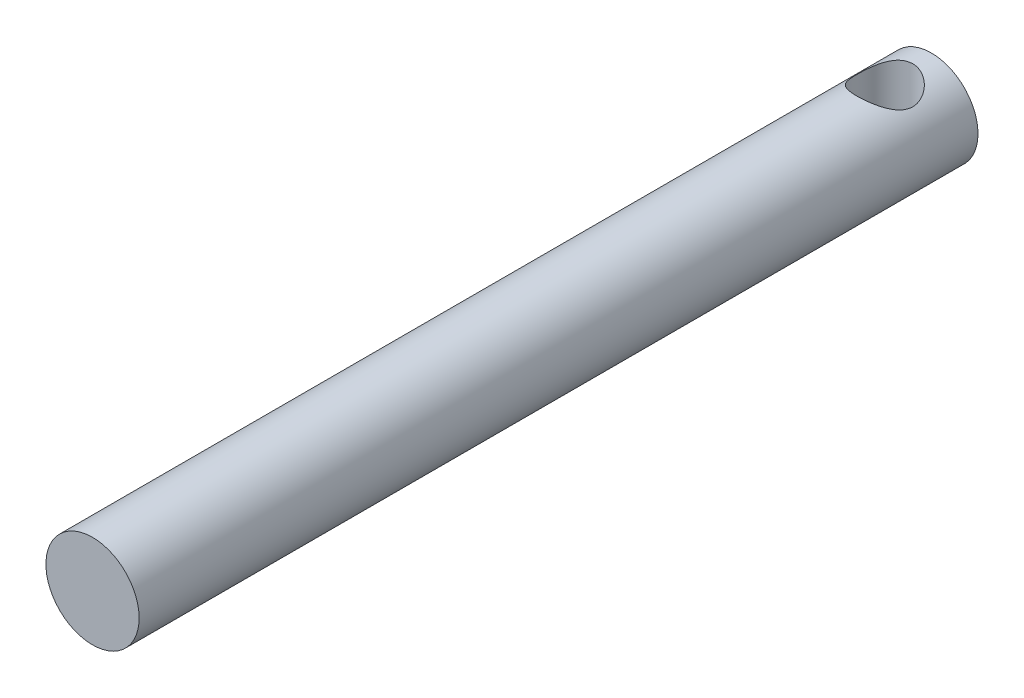
ISO-10303-21;
HEADER;
FILE_DESCRIPTION(('STEP AP214'),'2;1');
FILE_NAME('part.step','',(''),(''),'','','');
FILE_SCHEMA(('AUTOMOTIVE_DESIGN { 1 0 10303 214 1 1 1 1 }'));
ENDSEC;
DATA;
#1=APPLICATION_CONTEXT('core data for automotive mechanical design processes');
#2=APPLICATION_PROTOCOL_DEFINITION('international standard','automotive_design',2000,#1);
#3=PRODUCT_CONTEXT('',#1,'mechanical');
#4=PRODUCT('Part','Part','',(#3));
#5=PRODUCT_RELATED_PRODUCT_CATEGORY('part','',(#4));
#6=PRODUCT_DEFINITION_FORMATION('','',#4);
#7=PRODUCT_DEFINITION_CONTEXT('part definition',#1,'design');
#8=PRODUCT_DEFINITION('design','',#6,#7);
#9=PRODUCT_DEFINITION_SHAPE('','',#8);
#10=(LENGTH_UNIT() NAMED_UNIT(*) SI_UNIT(.MILLI.,.METRE.));
#11=(NAMED_UNIT(*) PLANE_ANGLE_UNIT() SI_UNIT($,.RADIAN.));
#12=(NAMED_UNIT(*) SI_UNIT($,.STERADIAN.) SOLID_ANGLE_UNIT());
#13=UNCERTAINTY_MEASURE_WITH_UNIT(LENGTH_MEASURE(1.E-05),#10,'distance_accuracy_value','');
#14=(GEOMETRIC_REPRESENTATION_CONTEXT(3) GLOBAL_UNCERTAINTY_ASSIGNED_CONTEXT((#13)) GLOBAL_UNIT_ASSIGNED_CONTEXT((#10,
#11,#12)) REPRESENTATION_CONTEXT('',''));
#15=CARTESIAN_POINT('',(0.,0.,0.));
#16=DIRECTION('',(0.,0.,1.));
#17=DIRECTION('',(1.,0.,0.));
#18=AXIS2_PLACEMENT_3D('',#15,#16,#17);
#19=CARTESIAN_POINT('',(-13.5091901350102,11.4106751625815,180.));
#20=DIRECTION('',(0.,0.,-1.));
#21=DIRECTION('',(-1.,0.,0.));
#22=AXIS2_PLACEMENT_3D('',#19,#20,#21);
#23=CYLINDRICAL_SURFACE('',#22,10.);
#24=CARTESIAN_POINT('',(-13.5091901350102,11.4106751625815,180.));
#25=DIRECTION('',(0.,0.,1.));
#26=DIRECTION('',(1.,0.,0.));
#27=AXIS2_PLACEMENT_3D('',#24,#25,#26);
#28=CIRCLE('',#27,10.);
#29=CARTESIAN_POINT('',(-3.50919013501023,11.4106751625815,180.));
#30=VERTEX_POINT('',#29);
#31=EDGE_CURVE('E10',#30,#30,#28,.T.);
#32=ORIENTED_EDGE('',*,*,#31,.F.);
#33=EDGE_LOOP('',(#32));
#34=FACE_BOUND('',#33,.T.);
#35=CARTESIAN_POINT('',(-13.5091901350102,11.4106751625815,0.));
#36=DIRECTION('',(0.,0.,1.));
#37=DIRECTION('',(1.,0.,0.));
#38=AXIS2_PLACEMENT_3D('',#35,#36,#37);
#39=CIRCLE('',#38,10.);
#40=CARTESIAN_POINT('',(-3.50919013501023,11.4106751625815,0.));
#41=VERTEX_POINT('',#40);
#42=EDGE_CURVE('E44',#41,#41,#39,.T.);
#43=ORIENTED_EDGE('',*,*,#42,.T.);
#44=EDGE_LOOP('',(#43));
#45=FACE_BOUND('',#44,.T.);
#46=CARTESIAN_POINT('',(-13.5091901350102,1.41067516258146,4.00000000000001));
#47=CARTESIAN_POINT('',(-13.3556526904588,1.41067633089501,4.00000125480863));
#48=CARTESIAN_POINT('',(-13.2020764056153,1.41422020166984,4.00590264260054));
#49=CARTESIAN_POINT('',(-12.8960826136834,1.42831151794474,4.02943301315885));
#50=CARTESIAN_POINT('',(-12.7436658374102,1.43886306127211,4.04706885781215));
#51=CARTESIAN_POINT('',(-12.4409426835004,1.46673266339194,4.09387210434918));
#52=CARTESIAN_POINT('',(-12.290640862491,1.48406353208247,4.1230613382259));
#53=CARTESIAN_POINT('',(-11.9934701077363,1.52507410980967,4.19259993825845));
#54=CARTESIAN_POINT('',(-11.8466026689503,1.54875652968652,4.23295406982232));
#55=CARTESIAN_POINT('',(-11.5580945197007,1.60177034291241,4.32408760089697));
#56=CARTESIAN_POINT('',(-11.416429738108,1.631070330933,4.37480914043));
#57=CARTESIAN_POINT('',(-11.1382592970138,1.69475587741807,4.48627436911144));
#58=CARTESIAN_POINT('',(-11.0017556559548,1.72914340023012,4.5470219304578));
#59=CARTESIAN_POINT('',(-10.601227218424,1.8388335395481,4.74338407851943));
#60=CARTESIAN_POINT('',(-10.3458203590017,1.92073348435578,4.89323485933393));
#61=CARTESIAN_POINT('',(-9.84395243429926,2.10246446164923,5.23910814308137));
#62=CARTESIAN_POINT('',(-9.59966901020869,2.20318776396261,5.43778513248692));
#63=CARTESIAN_POINT('',(-9.14564434458899,2.40947332513383,5.86989850217798));
#64=CARTESIAN_POINT('',(-8.93594811126803,2.51504166413627,6.10337943262662));
#65=CARTESIAN_POINT('',(-8.63836434718179,2.67626349301655,6.49199899782079));
#66=CARTESIAN_POINT('',(-8.53736682658386,2.73351791785553,6.63663261824515));
#67=CARTESIAN_POINT('',(-8.34796890769963,2.84482198475617,6.93519435737639));
#68=CARTESIAN_POINT('',(-8.25957058995719,2.89887109665648,7.08912400520267));
#69=CARTESIAN_POINT('',(-8.09628238263426,3.00176672522986,7.40537768241328));
#70=CARTESIAN_POINT('',(-8.02137485315563,3.05062000097349,7.56769038766835));
#71=CARTESIAN_POINT('',(-7.88580850147011,3.14119926934413,7.90005817081948));
#72=CARTESIAN_POINT('',(-7.82514436188687,3.18292792016087,8.07011033100857));
#73=CARTESIAN_POINT('',(-7.73181791608264,3.24829904703414,8.37492007913803));
#74=CARTESIAN_POINT('',(-7.69593123990293,3.27387561962415,8.5082833488659));
#75=CARTESIAN_POINT('',(-7.63328974150352,3.31899495134789,8.7781295178189));
#76=CARTESIAN_POINT('',(-7.60653289619657,3.33853904713176,8.91461171875597));
#77=CARTESIAN_POINT('',(-7.56252042961355,3.37090726380086,9.18974828597867));
#78=CARTESIAN_POINT('',(-7.54525504469453,3.38373828960505,9.32840026864179));
#79=CARTESIAN_POINT('',(-7.52043747120673,3.4022369086812,9.60705501530098));
#80=CARTESIAN_POINT('',(-7.51288544983306,3.4079043786476,9.74705780250652));
#81=CARTESIAN_POINT('',(-7.50761022729805,3.41185960957051,10.027630485736));
#82=CARTESIAN_POINT('',(-7.50990640534626,3.41013282017214,10.1682009556071));
#83=CARTESIAN_POINT('',(-7.52433344890707,3.39933508904413,10.448547368446));
#84=CARTESIAN_POINT('',(-7.53646436220422,3.39026411163088,10.5883233075501));
#85=CARTESIAN_POINT('',(-7.5703842946277,3.36511551060935,10.8661231944088));
#86=CARTESIAN_POINT('',(-7.59217766853591,3.34903472780143,11.0041463233038));
#87=CARTESIAN_POINT('',(-7.64511119353327,3.31045044389858,11.277494591076));
#88=CARTESIAN_POINT('',(-7.6762551644796,3.28794431814091,11.4128186031844));
#89=CARTESIAN_POINT('',(-7.78220949699514,3.21255389168456,11.8099607815556));
#90=CARTESIAN_POINT('',(-7.8700381936975,3.15140628119719,12.0668706370872));
#91=CARTESIAN_POINT('',(-8.07738966007996,3.01359352679295,12.5628175566807));
#92=CARTESIAN_POINT('',(-8.19692404850848,2.93692269673821,12.8018480274799));
#93=CARTESIAN_POINT('',(-8.48848936537285,2.76045281522607,13.2999480266043));
#94=CARTESIAN_POINT('',(-8.66604463379952,2.65895374187928,13.5552148804663));
#95=CARTESIAN_POINT('',(-8.95961889220411,2.50485105529802,13.9147691760174));
#96=CARTESIAN_POINT('',(-9.06210694926763,2.45313380210121,14.0308102231317));
#97=CARTESIAN_POINT('',(-9.27589575699475,2.35014100583064,14.2547824138109));
#98=CARTESIAN_POINT('',(-9.38719807317838,2.29886554302554,14.3627121100362));
#99=CARTESIAN_POINT('',(-9.63437156022612,2.19078189687765,14.5844378033889));
#100=CARTESIAN_POINT('',(-9.77150218235584,2.13420233892975,14.6969446098408));
#101=CARTESIAN_POINT('',(-10.0560489055857,2.02456575116488,14.9099266645909));
#102=CARTESIAN_POINT('',(-10.2034609792843,1.97150735777188,15.0104065825761));
#103=CARTESIAN_POINT('',(-10.5078895353287,1.87034414124565,15.1984805100332));
#104=CARTESIAN_POINT('',(-10.6649048767325,1.82223873147523,15.2860760460744));
#105=CARTESIAN_POINT('',(-10.9876322992274,1.7323597166042,15.447410241838));
#106=CARTESIAN_POINT('',(-11.1533432976371,1.6905853257456,15.5211506214301));
#107=CARTESIAN_POINT('',(-11.4816173528806,1.61703260991048,15.649604220474));
#108=CARTESIAN_POINT('',(-11.6437216198297,1.58479049470757,15.705223147606));
#109=CARTESIAN_POINT('',(-11.9733429143315,1.52790560786429,15.8026459542524));
#110=CARTESIAN_POINT('',(-12.1408597863822,1.50326261811808,15.8444502302696));
#111=CARTESIAN_POINT('',(-12.4796964443595,1.46234697777783,15.9135444927888));
#112=CARTESIAN_POINT('',(-12.651012261636,1.44606598506837,15.9408489455662));
#113=CARTESIAN_POINT('',(-12.995963828978,1.42235847492357,15.9805289353702));
#114=CARTESIAN_POINT('',(-13.169599249275,1.41493071212589,15.9929065721187));
#115=CARTESIAN_POINT('',(-13.4937615407638,1.40955699642827,16.0018638200681));
#116=CARTESIAN_POINT('',(-13.6442204517033,1.41045916052588,16.0003625940574));
#117=CARTESIAN_POINT('',(-13.9444083961809,1.41902240356606,15.9860804379589));
#118=CARTESIAN_POINT('',(-14.0941374535988,1.42668325985994,15.9732998794413));
#119=CARTESIAN_POINT('',(-14.3917261916016,1.44857740972355,15.9366326369676));
#120=CARTESIAN_POINT('',(-14.5395859991371,1.46281025446386,15.9127467114441));
#121=CARTESIAN_POINT('',(-14.8324026071875,1.49750968958448,15.8541784518886));
#122=CARTESIAN_POINT('',(-14.9773593355284,1.51797643474231,15.8194958497924));
#123=CARTESIAN_POINT('',(-15.2599092213005,1.5641041180475,15.740727839033));
#124=CARTESIAN_POINT('',(-15.397595803268,1.58962482043852,15.6968948586283));
#125=CARTESIAN_POINT('',(-15.6685804277553,1.6456246196643,15.599801467025));
#126=CARTESIAN_POINT('',(-15.8018770397861,1.67610531388146,15.5465380182235));
#127=CARTESIAN_POINT('',(-16.1941154951224,1.77409806055428,15.3733367560108));
#128=CARTESIAN_POINT('',(-16.4456129988504,1.84819591132159,15.2399295203489));
#129=CARTESIAN_POINT('',(-16.9492514293292,2.01685816939208,14.9257648803305));
#130=CARTESIAN_POINT('',(-17.1987515501651,2.11274843013203,14.7415307371737));
#131=CARTESIAN_POINT('',(-17.6653094647064,2.31171917956937,14.3384083420504));
#132=CARTESIAN_POINT('',(-17.8823289273424,2.41480795631984,14.1194797638093));
#133=CARTESIAN_POINT('',(-18.1939520620779,2.57500336207024,13.7527651800899));
#134=CARTESIAN_POINT('',(-18.3007796383658,2.63263063783843,13.6153895839449));
#135=CARTESIAN_POINT('',(-18.5025165130105,2.74580074618911,13.3312226254713));
#136=CARTESIAN_POINT('',(-18.5974227301235,2.80134303728758,13.1844288436304));
#137=CARTESIAN_POINT('',(-18.7745358176519,2.9085077382194,12.8821531306063));
#138=CARTESIAN_POINT('',(-18.8567511775287,2.96013275662896,12.7266771029891));
#139=CARTESIAN_POINT('',(-19.007746415273,3.05759477398999,12.4076913158731));
#140=CARTESIAN_POINT('',(-19.0765357996783,3.10343586018284,12.2441873441473));
#141=CARTESIAN_POINT('',(-19.1865539936093,3.1783629131264,11.9460369976618));
#142=CARTESIAN_POINT('',(-19.2305272268551,3.20893032920928,11.8127706139868));
#143=CARTESIAN_POINT('',(-19.3092470438725,3.26440848747455,11.5424462632691));
#144=CARTESIAN_POINT('',(-19.3439984760487,3.28932220111529,11.4053903306202));
#145=CARTESIAN_POINT('',(-19.4038470235489,3.33265636395711,11.1283115957084));
#146=CARTESIAN_POINT('',(-19.4289536497945,3.35108320847234,10.9882918606535));
#147=CARTESIAN_POINT('',(-19.4692055082927,3.38080306172285,10.7060674786414));
#148=CARTESIAN_POINT('',(-19.4843506823846,3.39209602880638,10.5638628189323));
#149=CARTESIAN_POINT('',(-19.5044776683804,3.40713293974157,10.2777861758266));
#150=CARTESIAN_POINT('',(-19.509420507325,3.41084793508047,10.1339099024415));
#151=CARTESIAN_POINT('',(-19.508943252585,3.41049000722118,9.84618425972922));
#152=CARTESIAN_POINT('',(-19.5035231406872,3.40641707033552,9.70233489044975));
#153=CARTESIAN_POINT('',(-19.482406067439,3.39064629995863,9.41575104334118));
#154=CARTESIAN_POINT('',(-19.4667042186073,3.37894484021797,9.27301712841896));
#155=CARTESIAN_POINT('',(-19.4252686873262,3.34837560049076,8.98980184575889));
#156=CARTESIAN_POINT('',(-19.3995349634533,3.32950779091298,8.84932048732477));
#157=CARTESIAN_POINT('',(-19.3398852873669,3.28637353008559,8.5782741425903));
#158=CARTESIAN_POINT('',(-19.3064272262005,3.26241364733881,8.44755884079413));
#159=CARTESIAN_POINT('',(-19.2311281552567,3.20936161443327,8.18961425858702));
#160=CARTESIAN_POINT('',(-19.1892843184341,3.18026773387753,8.06238617028635));
#161=CARTESIAN_POINT('',(-19.0517537133091,3.08647485620229,7.68677253846046));
#162=CARTESIAN_POINT('',(-18.9440370609828,3.0152413229192,7.44432004652925));
#163=CARTESIAN_POINT('',(-18.6807558247923,2.85015170856296,6.94268726359622));
#164=CARTESIAN_POINT('',(-18.5203841455681,2.75450146407756,6.68665387437078));
#165=CARTESIAN_POINT('',(-18.1641907444778,2.5578602684448,6.20246140462519));
#166=CARTESIAN_POINT('',(-17.968339830484,2.4568649682156,5.97432553890186));
#167=CARTESIAN_POINT('',(-17.6328935497186,2.29948843442034,5.63816339612));
#168=CARTESIAN_POINT('',(-17.5039770846539,2.24209514305536,5.51977495732979));
#169=CARTESIAN_POINT('',(-17.2356594479173,2.12980527850933,5.2942465024977));
#170=CARTESIAN_POINT('',(-17.0962615016759,2.07490794553237,5.18710305019273));
#171=CARTESIAN_POINT('',(-16.8074768899532,1.96901328093463,4.98478199543339));
#172=CARTESIAN_POINT('',(-16.6580832197503,1.91801873908242,4.88961292170517));
#173=CARTESIAN_POINT('',(-16.3501547164646,1.82136090321719,4.71223314879596));
#174=CARTESIAN_POINT('',(-16.191621031385,1.77569694184295,4.63002082704426));
#175=CARTESIAN_POINT('',(-15.8713036290162,1.69229197176776,4.48179284417448));
#176=CARTESIAN_POINT('',(-15.7097643922493,1.65435263836645,4.41536150477391));
#177=CARTESIAN_POINT('',(-15.3801304005374,1.58581361897052,4.29646904680598));
#178=CARTESIAN_POINT('',(-15.2120369103091,1.55521252504908,4.24400524818978));
#179=CARTESIAN_POINT('',(-14.8711965220702,1.50236601022451,4.15398305664884));
#180=CARTESIAN_POINT('',(-14.6984659127734,1.48009462608659,4.11637832778531));
#181=CARTESIAN_POINT('',(-14.3495568511552,1.44450844182282,4.0565108073647));
#182=CARTESIAN_POINT('',(-14.1733813966024,1.43118618232676,4.03423523810279));
#183=CARTESIAN_POINT('',(-13.9154381553649,1.41860058764565,4.01321662762697));
#184=CARTESIAN_POINT('',(-13.8343030042426,1.41563110722131,4.00826302432284));
#185=CARTESIAN_POINT('',(-13.6718455843677,1.41166805097407,4.00165432094528));
#186=CARTESIAN_POINT('',(-13.5905233092224,1.41067454369236,3.99999933529201));
#187=CARTESIAN_POINT('',(-13.5091901350102,1.41067516258146,4.00000000000001));
#188=B_SPLINE_CURVE_WITH_KNOTS('',3,(#46,#47,#48,#49,#50,#51,#52,#53,#54,#55,#56,#57,#58,#59,
#60,#61,#62,#63,#64,#65,#66,#67,#68,#69,#70,#71,#72,#73,#74,#75,#76,#77,#78,#79,#80,#81,#82,#83,
#84,#85,#86,#87,#88,#89,#90,#91,#92,#93,#94,#95,#96,#97,#98,#99,#100,#101,#102,#103,#104,#105,
#106,#107,#108,#109,#110,#111,#112,#113,#114,#115,#116,#117,#118,#119,#120,#121,#122,#123,#124,
#125,#126,#127,#128,#129,#130,#131,#132,#133,#134,#135,#136,#137,#138,#139,#140,#141,#142,#143,
#144,#145,#146,#147,#148,#149,#150,#151,#152,#153,#154,#155,#156,#157,#158,#159,#160,#161,#162,
#163,#164,#165,#166,#167,#168,#169,#170,#171,#172,#173,#174,#175,#176,#177,#178,#179,#180,#181,
#182,#183,#184,#185,#186,#187),.UNSPECIFIED.,.T.,.F.,(4,2,2,2,2,2,2,2,2,2,2,2,2,2,2,2,2,2,2,2,2,
2,2,2,2,2,2,2,2,2,2,2,2,2,2,2,2,2,2,2,2,2,2,2,2,2,2,2,2,2,2,2,2,2,2,2,2,2,2,2,2,2,2,2,2,2,2,2,2,
2,4),(0.,0.460526601189237,0.921322738666801,1.38299381403058,1.8448622449067,2.30422013956032,
2.76375586197538,3.68167311554444,4.66978395284546,5.65917064091955,6.21499415637786,
6.77090935054837,7.32609229452151,7.88106764554411,8.30201487574485,8.72286876721019,
9.1432889221606,9.56371631366182,9.98497139806241,10.40622852925,10.8276757104407,
11.2492952938386,12.0807558666506,12.9125215553463,13.8897049719634,14.3790534646455,
14.8684890673691,15.4263461011955,15.983985828052,16.5415594312421,17.0990637758594,
17.6214641151699,18.1438494594443,18.6657126431692,19.1875024090024,19.638346895262,
20.0891765301004,20.5399753803935,20.9907854241961,21.4305002375878,21.8703569439357,
22.7494233427058,23.7197001490793,24.6911131196182,25.2405264723239,25.7900815377537,
26.3392673739261,26.8880629256888,27.3185187217206,27.7487477532128,28.1785514321197,
28.6083576204496,29.0398026540948,29.4712484460159,29.9028994771413,30.3345522906548,
30.7452488920627,31.156084182716,31.9773303104337,32.9246646516038,33.8727820243206,
34.4248169890476,34.9766827677429,35.5289394130231,36.0811268442983,36.6165634055116,
37.1518971546363,37.685548110701,38.2187536985203,38.4626993445494,38.706653452248),.UNSPECIFIED.);
#189=CARTESIAN_POINT('',(-13.5091901350102,1.41067516258146,4.00000000000001));
#190=VERTEX_POINT('',#189);
#191=EDGE_CURVE('E50',#190,#190,#188,.T.);
#192=ORIENTED_EDGE('',*,*,#191,.F.);
#193=EDGE_LOOP('',(#192));
#194=FACE_BOUND('',#193,.T.);
#195=CARTESIAN_POINT('',(-13.5091901350102,21.4106751625815,4.00000000000001));
#196=CARTESIAN_POINT('',(-13.6627275795617,21.4106739942679,4.00000125480863));
#197=CARTESIAN_POINT('',(-13.8163038644052,21.4071301234931,4.00590264260054));
#198=CARTESIAN_POINT('',(-14.1222976563371,21.3930388072182,4.02943301315885));
#199=CARTESIAN_POINT('',(-14.2747144326103,21.3824872638908,4.04706885781215));
#200=CARTESIAN_POINT('',(-14.5774375865201,21.354617661771,4.09387210434918));
#201=CARTESIAN_POINT('',(-14.7277394075295,21.3372867930805,4.1230613382259));
#202=CARTESIAN_POINT('',(-15.0249101622842,21.2962762153533,4.19259993825845));
#203=CARTESIAN_POINT('',(-15.1717776010701,21.2725937954764,4.23295406982232));
#204=CARTESIAN_POINT('',(-15.4602857503197,21.2195799822505,4.32408760089696));
#205=CARTESIAN_POINT('',(-15.6019505319124,21.1902799942299,4.37480914043));
#206=CARTESIAN_POINT('',(-15.8801209730067,21.1265944477449,4.48627436911143));
#207=CARTESIAN_POINT('',(-16.0166246140657,21.0922069249328,4.54702193045779));
#208=CARTESIAN_POINT('',(-16.4171530515964,20.9825167856148,4.74338407851942));
#209=CARTESIAN_POINT('',(-16.6725599110187,20.9006168408072,4.89323485933392));
#210=CARTESIAN_POINT('',(-17.1744278357212,20.7188858635137,5.23910814308136));
#211=CARTESIAN_POINT('',(-17.4187112598118,20.6181625612003,5.43778513248691));
#212=CARTESIAN_POINT('',(-17.8727359254315,20.4118770000291,5.86989850217797));
#213=CARTESIAN_POINT('',(-18.0824321587524,20.3063086610267,6.1033794326266));
#214=CARTESIAN_POINT('',(-18.3800159228387,20.1450868321464,6.49199899782077));
#215=CARTESIAN_POINT('',(-18.4810134434366,20.0878324073074,6.63663261824514));
#216=CARTESIAN_POINT('',(-18.6704113623208,19.9765283404068,6.93519435737637));
#217=CARTESIAN_POINT('',(-18.7588096800633,19.9224792285065,7.08912400520266));
#218=CARTESIAN_POINT('',(-18.9220978873862,19.8195835999331,7.40537768241326));
#219=CARTESIAN_POINT('',(-18.9970054168648,19.7707303241895,7.56769038766833));
#220=CARTESIAN_POINT('',(-19.1325717685503,19.6801510558188,7.90005817081946));
#221=CARTESIAN_POINT('',(-19.1932359081336,19.6384224050021,8.07011033100855));
#222=CARTESIAN_POINT('',(-19.2865623539378,19.5730512781288,8.37492007913801));
#223=CARTESIAN_POINT('',(-19.3224490301175,19.5474747055388,8.50828334886589));
#224=CARTESIAN_POINT('',(-19.3850905285169,19.502355373815,8.77812951781889));
#225=CARTESIAN_POINT('',(-19.4118473738239,19.4828112780312,8.91461171875596));
#226=CARTESIAN_POINT('',(-19.4558598404069,19.4504430613621,9.18974828597866));
#227=CARTESIAN_POINT('',(-19.4731252253259,19.4376120355579,9.32840026864178));
#228=CARTESIAN_POINT('',(-19.4979427988137,19.4191134164817,9.60705501530097));
#229=CARTESIAN_POINT('',(-19.5054948201874,19.4134459465153,9.74705780250651));
#230=CARTESIAN_POINT('',(-19.5107700427224,19.4094907155924,10.027630485736));
#231=CARTESIAN_POINT('',(-19.5084738646742,19.4112175049908,10.1682009556071));
#232=CARTESIAN_POINT('',(-19.4940468211134,19.4220152361188,10.448547368446));
#233=CARTESIAN_POINT('',(-19.4819159078162,19.4310862135321,10.5883233075501));
#234=CARTESIAN_POINT('',(-19.4479959753928,19.4562348145536,10.8661231944088));
#235=CARTESIAN_POINT('',(-19.4262026014846,19.4723155973615,11.0041463233038));
#236=CARTESIAN_POINT('',(-19.3732690764872,19.5108998812644,11.277494591076));
#237=CARTESIAN_POINT('',(-19.3421251055409,19.533406007022,11.4128186031844));
#238=CARTESIAN_POINT('',(-19.2361707730253,19.6087964334784,11.8099607815556));
#239=CARTESIAN_POINT('',(-19.148342076323,19.6699440439657,12.0668706370872));
#240=CARTESIAN_POINT('',(-18.9409906099405,19.80775679837,12.5628175566807));
#241=CARTESIAN_POINT('',(-18.821456221512,19.8844276284247,12.8018480274799));
#242=CARTESIAN_POINT('',(-18.5298909046476,20.0608975099369,13.2999480266043));
#243=CARTESIAN_POINT('',(-18.3523356362209,20.1623965832837,13.5552148804664));
#244=CARTESIAN_POINT('',(-18.0587613778163,20.3164992698649,13.9147691760174));
#245=CARTESIAN_POINT('',(-17.9562733207528,20.3682165230617,14.0308102231317));
#246=CARTESIAN_POINT('',(-17.7424845130257,20.4712093193323,14.2547824138109));
#247=CARTESIAN_POINT('',(-17.6311821968421,20.5224847821374,14.3627121100362));
#248=CARTESIAN_POINT('',(-17.3840087097943,20.6305684282853,14.5844378033889));
#249=CARTESIAN_POINT('',(-17.2468780876646,20.6871479862332,14.6969446098408));
#250=CARTESIAN_POINT('',(-16.9623313644347,20.7967845739981,14.9099266645909));
#251=CARTESIAN_POINT('',(-16.8149192907362,20.8498429673911,15.0104065825761));
#252=CARTESIAN_POINT('',(-16.5104907346918,20.9510061839173,15.1984805100333));
#253=CARTESIAN_POINT('',(-16.3534753932879,20.9991115936877,15.2860760460744));
#254=CARTESIAN_POINT('',(-16.030747970793,21.0889906085587,15.447410241838));
#255=CARTESIAN_POINT('',(-15.8650369723833,21.1307649994173,15.5211506214301));
#256=CARTESIAN_POINT('',(-15.5367629171398,21.2043177152525,15.649604220474));
#257=CARTESIAN_POINT('',(-15.3746586501908,21.2365598304554,15.705223147606));
#258=CARTESIAN_POINT('',(-15.045037355689,21.2934447172987,15.8026459542524));
#259=CARTESIAN_POINT('',(-14.8775204836382,21.3180877070449,15.8444502302697));
#260=CARTESIAN_POINT('',(-14.5386838256609,21.3590033473851,15.9135444927888));
#261=CARTESIAN_POINT('',(-14.3673680083845,21.3752843400946,15.9408489455662));
#262=CARTESIAN_POINT('',(-14.0224164410425,21.3989918502394,15.9805289353702));
#263=CARTESIAN_POINT('',(-13.8487810207454,21.406419613037,15.9929065721187));
#264=CARTESIAN_POINT('',(-13.5246187292566,21.4117933287347,16.0018638200681));
#265=CARTESIAN_POINT('',(-13.3741598183171,21.4108911646371,16.0003625940574));
#266=CARTESIAN_POINT('',(-13.0739718738395,21.4023279215969,15.9860804379589));
#267=CARTESIAN_POINT('',(-12.9242428164216,21.394667065303,15.9732998794413));
#268=CARTESIAN_POINT('',(-12.6266540784189,21.3727729154394,15.9366326369676));
#269=CARTESIAN_POINT('',(-12.4787942708833,21.3585400706991,15.9127467114441));
#270=CARTESIAN_POINT('',(-12.1859776628329,21.3238406355785,15.8541784518886));
#271=CARTESIAN_POINT('',(-12.0410209344921,21.3033738904206,15.8194958497924));
#272=CARTESIAN_POINT('',(-11.75847104872,21.2572462071154,15.740727839033));
#273=CARTESIAN_POINT('',(-11.6207844667525,21.2317255047244,15.6968948586283));
#274=CARTESIAN_POINT('',(-11.3497998422651,21.1757257054986,15.599801467025));
#275=CARTESIAN_POINT('',(-11.2165032302343,21.1452450112815,15.5465380182235));
#276=CARTESIAN_POINT('',(-10.8242647748981,21.0472522646087,15.3733367560108));
#277=CARTESIAN_POINT('',(-10.57276727117,20.9731544138414,15.2399295203489));
#278=CARTESIAN_POINT('',(-10.0691288406912,20.8044921557709,14.9257648803305));
#279=CARTESIAN_POINT('',(-9.81962871985541,20.7086018950309,14.7415307371737));
#280=CARTESIAN_POINT('',(-9.35307080531402,20.5096311455936,14.3384083420504));
#281=CARTESIAN_POINT('',(-9.13605134267802,20.4065423688431,14.1194797638093));
#282=CARTESIAN_POINT('',(-8.8244282079426,20.2463469630927,13.75276518009));
#283=CARTESIAN_POINT('',(-8.7176006316547,20.1887196873245,13.6153895839449));
#284=CARTESIAN_POINT('',(-8.51586375701,20.0755495789738,13.3312226254713));
#285=CARTESIAN_POINT('',(-8.42095753989694,20.0200072878754,13.1844288436304));
#286=CARTESIAN_POINT('',(-8.2438444523686,19.9128425869435,12.8821531306063));
#287=CARTESIAN_POINT('',(-8.16162909249174,19.861217568534,12.7266771029892));
#288=CARTESIAN_POINT('',(-8.01063385474747,19.763755551173,12.4076913158731));
#289=CARTESIAN_POINT('',(-7.94184447034218,19.7179144649801,12.2441873441473));
#290=CARTESIAN_POINT('',(-7.83182627641115,19.6429874120365,11.9460369976618));
#291=CARTESIAN_POINT('',(-7.78785304316534,19.6124199959537,11.8127706139868));
#292=CARTESIAN_POINT('',(-7.70913322614799,19.5569418376884,11.5424462632691));
#293=CARTESIAN_POINT('',(-7.67438179397178,19.5320281240476,11.4053903306202));
#294=CARTESIAN_POINT('',(-7.61453324647153,19.4886939612058,11.1283115957084));
#295=CARTESIAN_POINT('',(-7.58942662022595,19.4702671166906,10.9882918606535));
#296=CARTESIAN_POINT('',(-7.54917476172773,19.4405472634401,10.7060674786415));
#297=CARTESIAN_POINT('',(-7.53402958763588,19.4292542963566,10.5638628189323));
#298=CARTESIAN_POINT('',(-7.51390260164006,19.4142173854214,10.2777861758266));
#299=CARTESIAN_POINT('',(-7.50895976269547,19.4105023900825,10.1339099024415));
#300=CARTESIAN_POINT('',(-7.50943701743548,19.4108603179418,9.84618425972922));
#301=CARTESIAN_POINT('',(-7.51485712933322,19.4149332548274,9.70233489044976));
#302=CARTESIAN_POINT('',(-7.53597420258142,19.4307040252043,9.41575104334118));
#303=CARTESIAN_POINT('',(-7.55167605141314,19.442405484945,9.27301712841895));
#304=CARTESIAN_POINT('',(-7.59311158269425,19.4729747246722,8.98980184575889));
#305=CARTESIAN_POINT('',(-7.61884530656716,19.49184253425,8.84932048732477));
#306=CARTESIAN_POINT('',(-7.67849498265356,19.5349767950774,8.57827414259029));
#307=CARTESIAN_POINT('',(-7.71195304381996,19.5589366778241,8.44755884079413));
#308=CARTESIAN_POINT('',(-7.7872521147638,19.6119887107297,8.18961425858701));
#309=CARTESIAN_POINT('',(-7.82909595158638,19.6410825912854,8.06238617028635));
#310=CARTESIAN_POINT('',(-7.96662655671134,19.7348754689607,7.68677253846045));
#311=CARTESIAN_POINT('',(-8.07434320903765,19.8061090022437,7.44432004652924));
#312=CARTESIAN_POINT('',(-8.33762444522815,19.9711986166,6.94268726359621));
#313=CARTESIAN_POINT('',(-8.4979961244524,20.0668488610854,6.68665387437076));
#314=CARTESIAN_POINT('',(-8.85418952554267,20.2634900567181,6.20246140462517));
#315=CARTESIAN_POINT('',(-9.05004043953652,20.3644853569474,5.97432553890185));
#316=CARTESIAN_POINT('',(-9.38548672030189,20.5218618907426,5.63816339611999));
#317=CARTESIAN_POINT('',(-9.51440318536655,20.5792551821076,5.51977495732978));
#318=CARTESIAN_POINT('',(-9.78272082210314,20.6915450466536,5.29424650249768));
#319=CARTESIAN_POINT('',(-9.92211876834453,20.7464423796306,5.18710305019272));
#320=CARTESIAN_POINT('',(-10.2109033800673,20.8523370442283,4.98478199543337));
#321=CARTESIAN_POINT('',(-10.3602970502702,20.9033315860805,4.88961292170516));
#322=CARTESIAN_POINT('',(-10.6682255535559,20.9999894219458,4.71223314879595));
#323=CARTESIAN_POINT('',(-10.8267592386355,21.04565338332,4.63002082704425));
#324=CARTESIAN_POINT('',(-11.1470766410043,21.1290583533952,4.48179284417447));
#325=CARTESIAN_POINT('',(-11.3086158777712,21.1669976867965,4.4153615047739));
#326=CARTESIAN_POINT('',(-11.6382498694831,21.2355367061924,4.29646904680597));
#327=CARTESIAN_POINT('',(-11.8063433597114,21.2661378001139,4.24400524818978));
#328=CARTESIAN_POINT('',(-12.1471837479503,21.3189843149384,4.15398305664883));
#329=CARTESIAN_POINT('',(-12.3199143572471,21.3412556990764,4.11637832778531));
#330=CARTESIAN_POINT('',(-12.6688234188653,21.3768418833401,4.05651080736469));
#331=CARTESIAN_POINT('',(-12.8449988734181,21.3901641428362,4.03423523810278));
#332=CARTESIAN_POINT('',(-13.1029421146555,21.4027497375173,4.01321662762697));
#333=CARTESIAN_POINT('',(-13.1840772657779,21.4057192179416,4.00826302432284));
#334=CARTESIAN_POINT('',(-13.3465346856527,21.4096822741889,4.00165432094528));
#335=CARTESIAN_POINT('',(-13.4278569607981,21.4106757814706,3.99999933529201));
#336=CARTESIAN_POINT('',(-13.5091901350102,21.4106751625815,4.00000000000001));
#337=B_SPLINE_CURVE_WITH_KNOTS('',3,(#195,#196,#197,#198,#199,#200,#201,#202,#203,#204,#205,
#206,#207,#208,#209,#210,#211,#212,#213,#214,#215,#216,#217,#218,#219,#220,#221,#222,#223,#224,
#225,#226,#227,#228,#229,#230,#231,#232,#233,#234,#235,#236,#237,#238,#239,#240,#241,#242,#243,
#244,#245,#246,#247,#248,#249,#250,#251,#252,#253,#254,#255,#256,#257,#258,#259,#260,#261,#262,
#263,#264,#265,#266,#267,#268,#269,#270,#271,#272,#273,#274,#275,#276,#277,#278,#279,#280,#281,
#282,#283,#284,#285,#286,#287,#288,#289,#290,#291,#292,#293,#294,#295,#296,#297,#298,#299,#300,
#301,#302,#303,#304,#305,#306,#307,#308,#309,#310,#311,#312,#313,#314,#315,#316,#317,#318,#319,
#320,#321,#322,#323,#324,#325,#326,#327,#328,#329,#330,#331,#332,#333,#334,#335,#336),
.UNSPECIFIED.,.T.,.F.,(4,2,2,2,2,2,2,2,2,2,2,2,2,2,2,2,2,2,2,2,2,2,2,2,2,2,2,2,2,2,2,2,2,2,2,2,
2,2,2,2,2,2,2,2,2,2,2,2,2,2,2,2,2,2,2,2,2,2,2,2,2,2,2,2,2,2,2,2,2,2,4),(0.,0.460526601189237,
0.9213227386668,1.38299381403058,1.84486224490669,2.30422013956031,2.76375586197537,
3.68167311554442,4.66978395284544,5.65917064091953,6.21499415637784,6.77090935054835,
7.32609229452149,7.88106764554409,8.30201487574484,8.72286876721018,9.14328892216059,
9.56371631366181,9.9849713980624,10.40622852925,10.8276757104407,11.2492952938386,
12.0807558666506,12.9125215553463,13.8897049719634,14.3790534646455,14.8684890673691,
15.4263461011955,15.9839858280521,16.5415594312421,17.0990637758595,17.6214641151699,
18.1438494594443,18.6657126431692,19.1875024090024,19.638346895262,20.0891765301004,
20.5399753803935,20.9907854241961,21.4305002375878,21.8703569439357,22.7494233427058,
23.7197001490793,24.6911131196182,25.2405264723239,25.7900815377537,26.3392673739261,
26.8880629256888,27.3185187217206,27.7487477532128,28.1785514321197,28.6083576204495,
29.0398026540948,29.4712484460159,29.9028994771413,30.3345522906548,30.7452488920627,
31.156084182716,31.9773303104338,32.9246646516038,33.8727820243207,34.4248169890477,
34.9766827677429,35.5289394130232,36.0811268442983,36.6165634055116,37.1518971546363,
37.685548110701,38.2187536985203,38.4626993445494,38.706653452248),.UNSPECIFIED.);
#338=CARTESIAN_POINT('',(-13.5091901350102,21.4106751625815,4.00000000000001));
#339=VERTEX_POINT('',#338);
#340=EDGE_CURVE('E37',#339,#339,#337,.T.);
#341=ORIENTED_EDGE('',*,*,#340,.F.);
#342=EDGE_LOOP('',(#341));
#343=FACE_BOUND('',#342,.T.);
#344=ADVANCED_FACE('F33',(#34,#45,#194,#343),#23,.T.);
#345=CARTESIAN_POINT('',(-13.5091901350102,11.4106751625815,180.));
#346=DIRECTION('',(0.,0.,1.));
#347=DIRECTION('',(1.,0.,0.));
#348=AXIS2_PLACEMENT_3D('',#345,#346,#347);
#349=PLANE('',#348);
#350=ORIENTED_EDGE('',*,*,#31,.T.);
#351=EDGE_LOOP('',(#350));
#352=FACE_BOUND('',#351,.T.);
#353=ADVANCED_FACE('F60',(#352),#349,.T.);
#354=CARTESIAN_POINT('',(-13.5091901350102,11.4106751625815,0.));
#355=DIRECTION('',(0.,0.,1.));
#356=DIRECTION('',(1.,0.,0.));
#357=AXIS2_PLACEMENT_3D('',#354,#355,#356);
#358=PLANE('',#357);
#359=ORIENTED_EDGE('',*,*,#42,.F.);
#360=EDGE_LOOP('',(#359));
#361=FACE_BOUND('',#360,.T.);
#362=ADVANCED_FACE('F58',(#361),#358,.F.);
#363=CARTESIAN_POINT('',(-13.5091901350102,97.,10.));
#364=DIRECTION('',(0.,-1.,0.));
#365=DIRECTION('',(0.,0.,-1.));
#366=AXIS2_PLACEMENT_3D('',#363,#364,#365);
#367=CYLINDRICAL_SURFACE('',#366,6.);
#368=ORIENTED_EDGE('',*,*,#191,.T.);
#369=EDGE_LOOP('',(#368));
#370=FACE_BOUND('',#369,.T.);
#371=ORIENTED_EDGE('',*,*,#340,.T.);
#372=EDGE_LOOP('',(#371));
#373=FACE_BOUND('',#372,.T.);
#374=ADVANCED_FACE('F54',(#370,#373),#367,.F.);
#375=CLOSED_SHELL('',(#344,#353,#362,#374));
#376=MANIFOLD_SOLID_BREP('B2',#375);
#377=ADVANCED_BREP_SHAPE_REPRESENTATION('',(#18,#376),#14);
#378=SHAPE_DEFINITION_REPRESENTATION(#9,#377);
ENDSEC;
END-ISO-10303-21;
